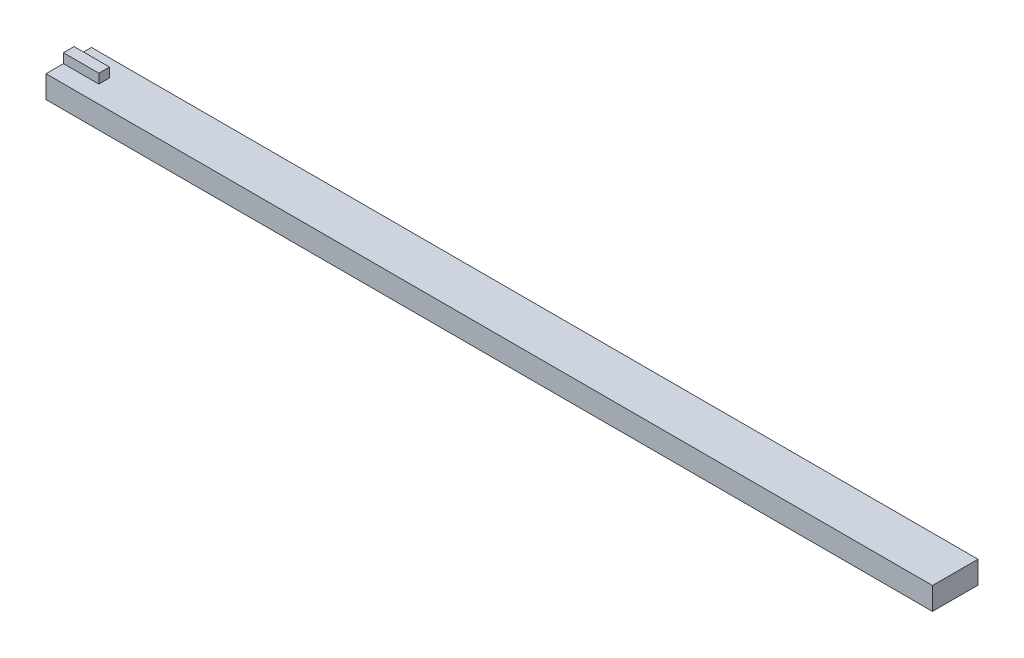
ISO-10303-21;
HEADER;
FILE_DESCRIPTION(('STEP AP214'),'2;1');
FILE_NAME('part.step','',(''),(''),'','','');
FILE_SCHEMA(('AUTOMOTIVE_DESIGN { 1 0 10303 214 1 1 1 1 }'));
ENDSEC;
DATA;
#1=APPLICATION_CONTEXT('core data for automotive mechanical design processes');
#2=APPLICATION_PROTOCOL_DEFINITION('international standard','automotive_design',2000,#1);
#3=PRODUCT_CONTEXT('',#1,'mechanical');
#4=PRODUCT('Part','Part','',(#3));
#5=PRODUCT_RELATED_PRODUCT_CATEGORY('part','',(#4));
#6=PRODUCT_DEFINITION_FORMATION('','',#4);
#7=PRODUCT_DEFINITION_CONTEXT('part definition',#1,'design');
#8=PRODUCT_DEFINITION('design','',#6,#7);
#9=PRODUCT_DEFINITION_SHAPE('','',#8);
#10=(LENGTH_UNIT() NAMED_UNIT(*) SI_UNIT(.MILLI.,.METRE.));
#11=(NAMED_UNIT(*) PLANE_ANGLE_UNIT() SI_UNIT($,.RADIAN.));
#12=(NAMED_UNIT(*) SI_UNIT($,.STERADIAN.) SOLID_ANGLE_UNIT());
#13=UNCERTAINTY_MEASURE_WITH_UNIT(LENGTH_MEASURE(1.E-05),#10,'distance_accuracy_value','');
#14=(GEOMETRIC_REPRESENTATION_CONTEXT(3) GLOBAL_UNCERTAINTY_ASSIGNED_CONTEXT((#13)) GLOBAL_UNIT_ASSIGNED_CONTEXT((#10,
#11,#12)) REPRESENTATION_CONTEXT('',''));
#15=CARTESIAN_POINT('',(0.,0.,0.));
#16=DIRECTION('',(0.,0.,1.));
#17=DIRECTION('',(1.,0.,0.));
#18=AXIS2_PLACEMENT_3D('',#15,#16,#17);
#19=CARTESIAN_POINT('',(150.,3.8,0.));
#20=DIRECTION('',(0.,-1.,0.));
#21=DIRECTION('',(0.,0.,-1.));
#22=AXIS2_PLACEMENT_3D('',#19,#20,#21);
#23=PLANE('',#22);
#24=DIRECTION('',(-1.,0.,0.));
#25=VECTOR('',#24,1.);
#26=CARTESIAN_POINT('',(6.,3.8,-4.75));
#27=LINE('',#26,#25);
#28=CARTESIAN_POINT('',(6.,3.8,-4.75));
#29=VERTEX_POINT('',#28);
#30=CARTESIAN_POINT('',(0.,3.8,-4.75));
#31=VERTEX_POINT('',#30);
#32=EDGE_CURVE('E48',#29,#31,#27,.T.);
#33=ORIENTED_EDGE('',*,*,#32,.F.);
#34=DIRECTION('',(0.,0.,-1.));
#35=VECTOR('',#34,1.);
#36=CARTESIAN_POINT('',(6.,3.8,-4.75));
#37=LINE('',#36,#35);
#38=CARTESIAN_POINT('',(6.,3.8,-2.95));
#39=VERTEX_POINT('',#38);
#40=EDGE_CURVE('E163',#39,#29,#37,.T.);
#41=ORIENTED_EDGE('',*,*,#40,.F.);
#42=DIRECTION('',(1.,0.,0.));
#43=VECTOR('',#42,1.);
#44=CARTESIAN_POINT('',(6.,3.8,-2.95));
#45=LINE('',#44,#43);
#46=CARTESIAN_POINT('',(0.,3.8,-2.95));
#47=VERTEX_POINT('',#46);
#48=EDGE_CURVE('E54',#47,#39,#45,.T.);
#49=ORIENTED_EDGE('',*,*,#48,.F.);
#50=DIRECTION('',(0.,0.,1.));
#51=VECTOR('',#50,1.);
#52=CARTESIAN_POINT('',(0.,3.8,0.));
#53=LINE('',#52,#51);
#54=CARTESIAN_POINT('',(0.,3.8,0.));
#55=VERTEX_POINT('',#54);
#56=EDGE_CURVE('E119',#47,#55,#53,.T.);
#57=ORIENTED_EDGE('',*,*,#56,.T.);
#58=DIRECTION('',(-1.,0.,0.));
#59=VECTOR('',#58,1.);
#60=CARTESIAN_POINT('',(150.,3.8,0.));
#61=LINE('',#60,#59);
#62=CARTESIAN_POINT('',(150.,3.8,0.));
#63=VERTEX_POINT('',#62);
#64=EDGE_CURVE('E138',#63,#55,#61,.T.);
#65=ORIENTED_EDGE('',*,*,#64,.F.);
#66=DIRECTION('',(0.,0.,1.));
#67=VECTOR('',#66,1.);
#68=CARTESIAN_POINT('',(150.,3.8,0.));
#69=LINE('',#68,#67);
#70=CARTESIAN_POINT('',(150.,3.8,-7.7));
#71=VERTEX_POINT('',#70);
#72=EDGE_CURVE('E137',#71,#63,#69,.T.);
#73=ORIENTED_EDGE('',*,*,#72,.F.);
#74=DIRECTION('',(-1.,0.,0.));
#75=VECTOR('',#74,1.);
#76=CARTESIAN_POINT('',(150.,3.8,-7.7));
#77=LINE('',#76,#75);
#78=CARTESIAN_POINT('',(0.,3.8,-7.7));
#79=VERTEX_POINT('',#78);
#80=EDGE_CURVE('E146',#71,#79,#77,.T.);
#81=ORIENTED_EDGE('',*,*,#80,.T.);
#82=EDGE_CURVE('E133',#79,#31,#53,.T.);
#83=ORIENTED_EDGE('',*,*,#82,.T.);
#84=EDGE_LOOP('',(#33,#41,#49,#57,#65,#73,#81,#83));
#85=FACE_BOUND('',#84,.T.);
#86=ADVANCED_FACE('F33',(#85),#23,.F.);
#87=CARTESIAN_POINT('',(150.,0.,0.));
#88=DIRECTION('',(0.,0.,-1.));
#89=DIRECTION('',(0.,1.,0.));
#90=AXIS2_PLACEMENT_3D('',#87,#88,#89);
#91=PLANE('',#90);
#92=DIRECTION('',(0.,-1.,0.));
#93=VECTOR('',#92,1.);
#94=CARTESIAN_POINT('',(0.,0.,0.));
#95=LINE('',#94,#93);
#96=CARTESIAN_POINT('',(0.,0.,0.));
#97=VERTEX_POINT('',#96);
#98=EDGE_CURVE('E120',#55,#97,#95,.T.);
#99=ORIENTED_EDGE('',*,*,#98,.T.);
#100=DIRECTION('',(-1.,0.,0.));
#101=VECTOR('',#100,1.);
#102=CARTESIAN_POINT('',(150.,0.,0.));
#103=LINE('',#102,#101);
#104=CARTESIAN_POINT('',(150.,0.,0.));
#105=VERTEX_POINT('',#104);
#106=EDGE_CURVE('E11',#105,#97,#103,.T.);
#107=ORIENTED_EDGE('',*,*,#106,.F.);
#108=DIRECTION('',(0.,-1.,0.));
#109=VECTOR('',#108,1.);
#110=CARTESIAN_POINT('',(150.,0.,0.));
#111=LINE('',#110,#109);
#112=EDGE_CURVE('E129',#63,#105,#111,.T.);
#113=ORIENTED_EDGE('',*,*,#112,.F.);
#114=ORIENTED_EDGE('',*,*,#64,.T.);
#115=EDGE_LOOP('',(#99,#107,#113,#114));
#116=FACE_BOUND('',#115,.T.);
#117=ADVANCED_FACE('F35',(#116),#91,.F.);
#118=CARTESIAN_POINT('',(150.,0.,0.));
#119=DIRECTION('',(0.,1.,0.));
#120=DIRECTION('',(0.,0.,1.));
#121=AXIS2_PLACEMENT_3D('',#118,#119,#120);
#122=PLANE('',#121);
#123=DIRECTION('',(0.,0.,-1.));
#124=VECTOR('',#123,1.);
#125=CARTESIAN_POINT('',(0.,0.,0.));
#126=LINE('',#125,#124);
#127=CARTESIAN_POINT('',(0.,0.,-7.7));
#128=VERTEX_POINT('',#127);
#129=EDGE_CURVE('E123',#97,#128,#126,.T.);
#130=ORIENTED_EDGE('',*,*,#129,.T.);
#131=DIRECTION('',(-1.,0.,0.));
#132=VECTOR('',#131,1.);
#133=CARTESIAN_POINT('',(150.,0.,-7.7));
#134=LINE('',#133,#132);
#135=CARTESIAN_POINT('',(150.,0.,-7.7));
#136=VERTEX_POINT('',#135);
#137=EDGE_CURVE('E41',#136,#128,#134,.T.);
#138=ORIENTED_EDGE('',*,*,#137,.F.);
#139=DIRECTION('',(0.,0.,-1.));
#140=VECTOR('',#139,1.);
#141=CARTESIAN_POINT('',(150.,0.,0.));
#142=LINE('',#141,#140);
#143=EDGE_CURVE('E132',#105,#136,#142,.T.);
#144=ORIENTED_EDGE('',*,*,#143,.F.);
#145=ORIENTED_EDGE('',*,*,#106,.T.);
#146=EDGE_LOOP('',(#130,#138,#144,#145));
#147=FACE_BOUND('',#146,.T.);
#148=ADVANCED_FACE('F185',(#147),#122,.F.);
#149=CARTESIAN_POINT('',(150.,0.,-7.7));
#150=DIRECTION('',(0.,0.,1.));
#151=DIRECTION('',(1.,0.,0.));
#152=AXIS2_PLACEMENT_3D('',#149,#150,#151);
#153=PLANE('',#152);
#154=DIRECTION('',(0.,1.,0.));
#155=VECTOR('',#154,1.);
#156=CARTESIAN_POINT('',(0.,0.,-7.7));
#157=LINE('',#156,#155);
#158=EDGE_CURVE('E141',#128,#79,#157,.T.);
#159=ORIENTED_EDGE('',*,*,#158,.T.);
#160=ORIENTED_EDGE('',*,*,#80,.F.);
#161=DIRECTION('',(0.,1.,0.));
#162=VECTOR('',#161,1.);
#163=CARTESIAN_POINT('',(150.,0.,-7.7));
#164=LINE('',#163,#162);
#165=EDGE_CURVE('E135',#136,#71,#164,.T.);
#166=ORIENTED_EDGE('',*,*,#165,.F.);
#167=ORIENTED_EDGE('',*,*,#137,.T.);
#168=EDGE_LOOP('',(#159,#160,#166,#167));
#169=FACE_BOUND('',#168,.T.);
#170=ADVANCED_FACE('F153',(#169),#153,.F.);
#171=CARTESIAN_POINT('',(150.,0.,0.));
#172=DIRECTION('',(-1.,0.,0.));
#173=DIRECTION('',(0.,0.,1.));
#174=AXIS2_PLACEMENT_3D('',#171,#172,#173);
#175=PLANE('',#174);
#176=ORIENTED_EDGE('',*,*,#112,.T.);
#177=ORIENTED_EDGE('',*,*,#143,.T.);
#178=ORIENTED_EDGE('',*,*,#165,.T.);
#179=ORIENTED_EDGE('',*,*,#72,.T.);
#180=EDGE_LOOP('',(#176,#177,#178,#179));
#181=FACE_BOUND('',#180,.T.);
#182=ADVANCED_FACE('F191',(#181),#175,.F.);
#183=CARTESIAN_POINT('',(0.,0.,0.));
#184=DIRECTION('',(-1.,0.,0.));
#185=DIRECTION('',(0.,0.,1.));
#186=AXIS2_PLACEMENT_3D('',#183,#184,#185);
#187=PLANE('',#186);
#188=ORIENTED_EDGE('',*,*,#98,.F.);
#189=ORIENTED_EDGE('',*,*,#56,.F.);
#190=DIRECTION('',(0.,-1.,0.));
#191=VECTOR('',#190,1.);
#192=CARTESIAN_POINT('',(0.,5.4,-2.95));
#193=LINE('',#192,#191);
#194=CARTESIAN_POINT('',(0.,5.4,-2.95));
#195=VERTEX_POINT('',#194);
#196=EDGE_CURVE('E101',#195,#47,#193,.T.);
#197=ORIENTED_EDGE('',*,*,#196,.F.);
#198=DIRECTION('',(0.,0.,1.));
#199=VECTOR('',#198,1.);
#200=CARTESIAN_POINT('',(0.,5.4,-4.75));
#201=LINE('',#200,#199);
#202=CARTESIAN_POINT('',(0.,5.4,-4.75));
#203=VERTEX_POINT('',#202);
#204=EDGE_CURVE('E107',#203,#195,#201,.T.);
#205=ORIENTED_EDGE('',*,*,#204,.F.);
#206=DIRECTION('',(0.,-1.,0.));
#207=VECTOR('',#206,1.);
#208=CARTESIAN_POINT('',(0.,5.4,-4.75));
#209=LINE('',#208,#207);
#210=EDGE_CURVE('E157',#203,#31,#209,.T.);
#211=ORIENTED_EDGE('',*,*,#210,.T.);
#212=ORIENTED_EDGE('',*,*,#82,.F.);
#213=ORIENTED_EDGE('',*,*,#158,.F.);
#214=ORIENTED_EDGE('',*,*,#129,.F.);
#215=EDGE_LOOP('',(#188,#189,#197,#205,#211,#212,#213,#214));
#216=FACE_BOUND('',#215,.T.);
#217=ADVANCED_FACE('F118',(#216),#187,.T.);
#218=CARTESIAN_POINT('',(6.,5.4,-2.95));
#219=DIRECTION('',(0.,0.,-1.));
#220=DIRECTION('',(-1.,0.,0.));
#221=AXIS2_PLACEMENT_3D('',#218,#219,#220);
#222=PLANE('',#221);
#223=ORIENTED_EDGE('',*,*,#48,.T.);
#224=DIRECTION('',(0.,-1.,0.));
#225=VECTOR('',#224,1.);
#226=CARTESIAN_POINT('',(6.,5.4,-2.95));
#227=LINE('',#226,#225);
#228=CARTESIAN_POINT('',(6.,5.4,-2.95));
#229=VERTEX_POINT('',#228);
#230=EDGE_CURVE('E103',#229,#39,#227,.T.);
#231=ORIENTED_EDGE('',*,*,#230,.F.);
#232=DIRECTION('',(1.,0.,0.));
#233=VECTOR('',#232,1.);
#234=CARTESIAN_POINT('',(6.,5.4,-2.95));
#235=LINE('',#234,#233);
#236=EDGE_CURVE('E97',#195,#229,#235,.T.);
#237=ORIENTED_EDGE('',*,*,#236,.F.);
#238=ORIENTED_EDGE('',*,*,#196,.T.);
#239=EDGE_LOOP('',(#223,#231,#237,#238));
#240=FACE_BOUND('',#239,.T.);
#241=ADVANCED_FACE('F99',(#240),#222,.F.);
#242=CARTESIAN_POINT('',(6.,5.4,-4.75));
#243=DIRECTION('',(-1.,0.,0.));
#244=DIRECTION('',(0.,0.,1.));
#245=AXIS2_PLACEMENT_3D('',#242,#243,#244);
#246=PLANE('',#245);
#247=ORIENTED_EDGE('',*,*,#40,.T.);
#248=DIRECTION('',(0.,-1.,0.));
#249=VECTOR('',#248,1.);
#250=CARTESIAN_POINT('',(6.,5.4,-4.75));
#251=LINE('',#250,#249);
#252=CARTESIAN_POINT('',(6.,5.4,-4.75));
#253=VERTEX_POINT('',#252);
#254=EDGE_CURVE('E125',#253,#29,#251,.T.);
#255=ORIENTED_EDGE('',*,*,#254,.F.);
#256=DIRECTION('',(0.,0.,-1.));
#257=VECTOR('',#256,1.);
#258=CARTESIAN_POINT('',(6.,5.4,-4.75));
#259=LINE('',#258,#257);
#260=EDGE_CURVE('E106',#229,#253,#259,.T.);
#261=ORIENTED_EDGE('',*,*,#260,.F.);
#262=ORIENTED_EDGE('',*,*,#230,.T.);
#263=EDGE_LOOP('',(#247,#255,#261,#262));
#264=FACE_BOUND('',#263,.T.);
#265=ADVANCED_FACE('F171',(#264),#246,.F.);
#266=CARTESIAN_POINT('',(6.,5.4,-4.75));
#267=DIRECTION('',(0.,0.,1.));
#268=DIRECTION('',(1.,0.,0.));
#269=AXIS2_PLACEMENT_3D('',#266,#267,#268);
#270=PLANE('',#269);
#271=ORIENTED_EDGE('',*,*,#32,.T.);
#272=ORIENTED_EDGE('',*,*,#210,.F.);
#273=DIRECTION('',(-1.,0.,0.));
#274=VECTOR('',#273,1.);
#275=CARTESIAN_POINT('',(6.,5.4,-4.75));
#276=LINE('',#275,#274);
#277=EDGE_CURVE('E112',#253,#203,#276,.T.);
#278=ORIENTED_EDGE('',*,*,#277,.F.);
#279=ORIENTED_EDGE('',*,*,#254,.T.);
#280=EDGE_LOOP('',(#271,#272,#278,#279));
#281=FACE_BOUND('',#280,.T.);
#282=ADVANCED_FACE('F161',(#281),#270,.F.);
#283=CARTESIAN_POINT('',(0.,5.4,0.));
#284=DIRECTION('',(0.,-1.,0.));
#285=DIRECTION('',(0.,0.,-1.));
#286=AXIS2_PLACEMENT_3D('',#283,#284,#285);
#287=PLANE('',#286);
#288=ORIENTED_EDGE('',*,*,#204,.T.);
#289=ORIENTED_EDGE('',*,*,#236,.T.);
#290=ORIENTED_EDGE('',*,*,#260,.T.);
#291=ORIENTED_EDGE('',*,*,#277,.T.);
#292=EDGE_LOOP('',(#288,#289,#290,#291));
#293=FACE_BOUND('',#292,.T.);
#294=ADVANCED_FACE('F110',(#293),#287,.F.);
#295=CLOSED_SHELL('',(#86,#117,#148,#170,#182,#217,#241,#265,#282,#294));
#296=MANIFOLD_SOLID_BREP('B2',#295);
#297=ADVANCED_BREP_SHAPE_REPRESENTATION('',(#18,#296),#14);
#298=SHAPE_DEFINITION_REPRESENTATION(#9,#297);
ENDSEC;
END-ISO-10303-21;
